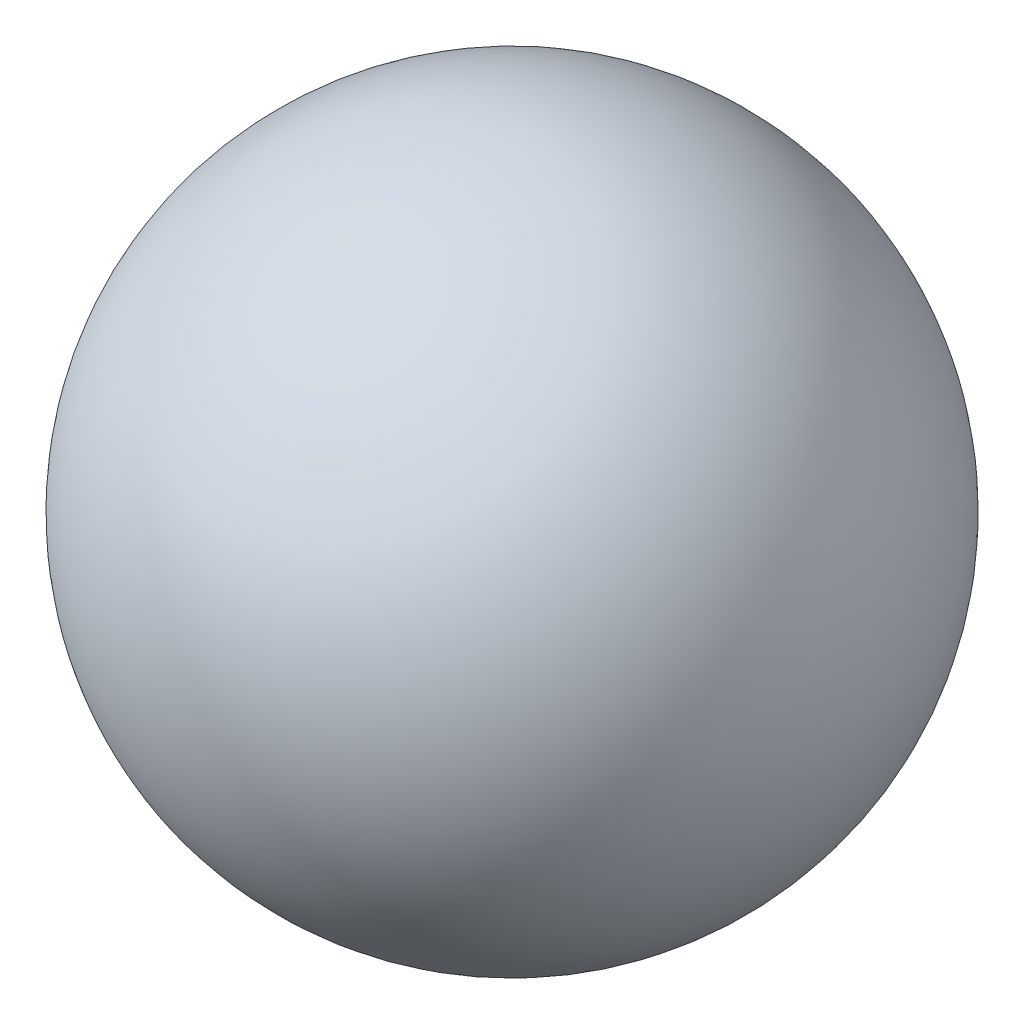
ISO-10303-21;
HEADER;
FILE_DESCRIPTION(('STEP AP214'),'2;1');
FILE_NAME('part.step','',(''),(''),'','','');
FILE_SCHEMA(('AUTOMOTIVE_DESIGN { 1 0 10303 214 1 1 1 1 }'));
ENDSEC;
DATA;
#1=APPLICATION_CONTEXT('core data for automotive mechanical design processes');
#2=APPLICATION_PROTOCOL_DEFINITION('international standard','automotive_design',2000,#1);
#3=PRODUCT_CONTEXT('',#1,'mechanical');
#4=PRODUCT('Part','Part','',(#3));
#5=PRODUCT_RELATED_PRODUCT_CATEGORY('part','',(#4));
#6=PRODUCT_DEFINITION_FORMATION('','',#4);
#7=PRODUCT_DEFINITION_CONTEXT('part definition',#1,'design');
#8=PRODUCT_DEFINITION('design','',#6,#7);
#9=PRODUCT_DEFINITION_SHAPE('','',#8);
#10=(LENGTH_UNIT() NAMED_UNIT(*) SI_UNIT(.MILLI.,.METRE.));
#11=(NAMED_UNIT(*) PLANE_ANGLE_UNIT() SI_UNIT($,.RADIAN.));
#12=(NAMED_UNIT(*) SI_UNIT($,.STERADIAN.) SOLID_ANGLE_UNIT());
#13=UNCERTAINTY_MEASURE_WITH_UNIT(LENGTH_MEASURE(1.E-05),#10,'distance_accuracy_value','');
#14=(GEOMETRIC_REPRESENTATION_CONTEXT(3) GLOBAL_UNCERTAINTY_ASSIGNED_CONTEXT((#13)) GLOBAL_UNIT_ASSIGNED_CONTEXT((#10,
#11,#12)) REPRESENTATION_CONTEXT('',''));
#15=CARTESIAN_POINT('',(0.,0.,0.));
#16=DIRECTION('',(0.,0.,1.));
#17=DIRECTION('',(1.,0.,0.));
#18=AXIS2_PLACEMENT_3D('',#15,#16,#17);
#19=CARTESIAN_POINT('',(0.,0.,0.));
#20=DIRECTION('',(0.,0.,1.));
#21=DIRECTION('',(-1.,0.,0.));
#22=AXIS2_PLACEMENT_3D('',#19,#20,#21);
#23=SPHERICAL_SURFACE('',#22,44.45);
#24=CARTESIAN_POINT('',(0.,0.,44.45));
#25=VERTEX_POINT('',#24);
#26=VERTEX_LOOP('',#25);
#27=FACE_BOUND('',#26,.T.);
#28=ADVANCED_FACE('F37',(#27),#23,.T.);
#29=CLOSED_SHELL('',(#28));
#30=CARTESIAN_POINT('',(0.,0.,0.));
#31=DIRECTION('',(0.,0.,1.));
#32=DIRECTION('',(-1.,0.,0.));
#33=AXIS2_PLACEMENT_3D('',#30,#31,#32);
#34=SPHERICAL_SURFACE('',#33,42.45);
#35=CARTESIAN_POINT('',(0.,0.,42.45));
#36=VERTEX_POINT('',#35);
#37=VERTEX_LOOP('',#36);
#38=FACE_BOUND('',#37,.T.);
#39=ADVANCED_FACE('F50',(#38),#34,.F.);
#40=CLOSED_SHELL('',(#39));
#41=ORIENTED_CLOSED_SHELL('',*,#40,.T.);
#42=BREP_WITH_VOIDS('B2',#29,(#41));
#43=ADVANCED_BREP_SHAPE_REPRESENTATION('',(#18,#42),#14);
#44=SHAPE_DEFINITION_REPRESENTATION(#9,#43);
ENDSEC;
END-ISO-10303-21;
